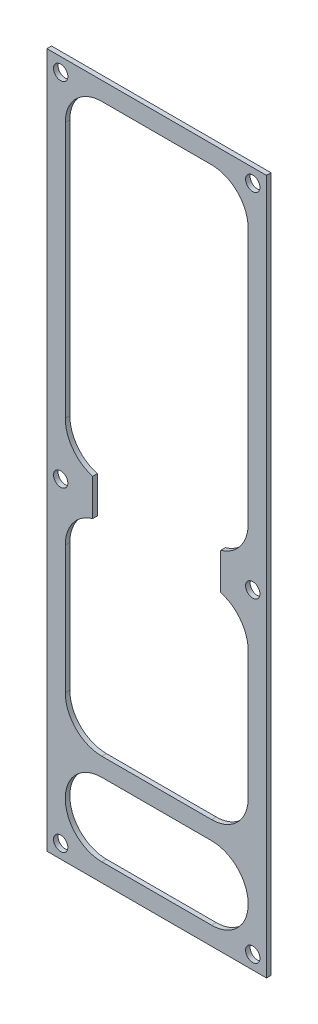
ISO-10303-21;
HEADER;
FILE_DESCRIPTION(('STEP AP214'),'2;1');
FILE_NAME('part.step','',(''),(''),'','','');
FILE_SCHEMA(('AUTOMOTIVE_DESIGN { 1 0 10303 214 1 1 1 1 }'));
ENDSEC;
DATA;
#1=APPLICATION_CONTEXT('core data for automotive mechanical design processes');
#2=APPLICATION_PROTOCOL_DEFINITION('international standard','automotive_design',2000,#1);
#3=PRODUCT_CONTEXT('',#1,'mechanical');
#4=PRODUCT('Part','Part','',(#3));
#5=PRODUCT_RELATED_PRODUCT_CATEGORY('part','',(#4));
#6=PRODUCT_DEFINITION_FORMATION('','',#4);
#7=PRODUCT_DEFINITION_CONTEXT('part definition',#1,'design');
#8=PRODUCT_DEFINITION('design','',#6,#7);
#9=PRODUCT_DEFINITION_SHAPE('','',#8);
#10=(LENGTH_UNIT() NAMED_UNIT(*) SI_UNIT(.MILLI.,.METRE.));
#11=(NAMED_UNIT(*) PLANE_ANGLE_UNIT() SI_UNIT($,.RADIAN.));
#12=(NAMED_UNIT(*) SI_UNIT($,.STERADIAN.) SOLID_ANGLE_UNIT());
#13=UNCERTAINTY_MEASURE_WITH_UNIT(LENGTH_MEASURE(1.E-05),#10,'distance_accuracy_value','');
#14=(GEOMETRIC_REPRESENTATION_CONTEXT(3) GLOBAL_UNCERTAINTY_ASSIGNED_CONTEXT((#13)) GLOBAL_UNIT_ASSIGNED_CONTEXT((#10,
#11,#12)) REPRESENTATION_CONTEXT('',''));
#15=CARTESIAN_POINT('',(0.,0.,0.));
#16=DIRECTION('',(0.,0.,1.));
#17=DIRECTION('',(1.,0.,0.));
#18=AXIS2_PLACEMENT_3D('',#15,#16,#17);
#19=CARTESIAN_POINT('',(0.,0.,1.5875));
#20=DIRECTION('',(1.,0.,0.));
#21=DIRECTION('',(0.,1.,0.));
#22=AXIS2_PLACEMENT_3D('',#19,#20,#21);
#23=PLANE('',#22);
#24=DIRECTION('',(0.,-1.,0.));
#25=VECTOR('',#24,1.);
#26=CARTESIAN_POINT('',(0.,0.,0.));
#27=LINE('',#26,#25);
#28=CARTESIAN_POINT('',(0.,0.,0.));
#29=VERTEX_POINT('',#28);
#30=CARTESIAN_POINT('',(0.,-241.3,0.));
#31=VERTEX_POINT('',#30);
#32=EDGE_CURVE('E308',#29,#31,#27,.T.);
#33=ORIENTED_EDGE('',*,*,#32,.T.);
#34=DIRECTION('',(0.,0.,-1.));
#35=VECTOR('',#34,1.);
#36=CARTESIAN_POINT('',(0.,-241.3,1.5875));
#37=LINE('',#36,#35);
#38=CARTESIAN_POINT('',(0.,-241.3,1.5875));
#39=VERTEX_POINT('',#38);
#40=EDGE_CURVE('E11',#39,#31,#37,.T.);
#41=ORIENTED_EDGE('',*,*,#40,.F.);
#42=DIRECTION('',(0.,-1.,0.));
#43=VECTOR('',#42,1.);
#44=CARTESIAN_POINT('',(0.,0.,1.5875));
#45=LINE('',#44,#43);
#46=CARTESIAN_POINT('',(0.,0.,1.5875));
#47=VERTEX_POINT('',#46);
#48=EDGE_CURVE('E366',#47,#39,#45,.T.);
#49=ORIENTED_EDGE('',*,*,#48,.F.);
#50=DIRECTION('',(0.,0.,-1.));
#51=VECTOR('',#50,1.);
#52=CARTESIAN_POINT('',(0.,0.,1.5875));
#53=LINE('',#52,#51);
#54=EDGE_CURVE('E376',#47,#29,#53,.T.);
#55=ORIENTED_EDGE('',*,*,#54,.T.);
#56=EDGE_LOOP('',(#33,#41,#49,#55));
#57=FACE_BOUND('',#56,.T.);
#58=ADVANCED_FACE('F36',(#57),#23,.F.);
#59=CARTESIAN_POINT('',(0.,-241.3,1.5875));
#60=DIRECTION('',(0.,1.,0.));
#61=DIRECTION('',(0.,0.,1.));
#62=AXIS2_PLACEMENT_3D('',#59,#60,#61);
#63=PLANE('',#62);
#64=DIRECTION('',(1.,0.,0.));
#65=VECTOR('',#64,1.);
#66=CARTESIAN_POINT('',(0.,-241.3,0.));
#67=LINE('',#66,#65);
#68=CARTESIAN_POINT('',(76.2,-241.3,0.));
#69=VERTEX_POINT('',#68);
#70=EDGE_CURVE('E379',#31,#69,#67,.T.);
#71=ORIENTED_EDGE('',*,*,#70,.T.);
#72=DIRECTION('',(0.,0.,-1.));
#73=VECTOR('',#72,1.);
#74=CARTESIAN_POINT('',(76.2,-241.3,1.5875));
#75=LINE('',#74,#73);
#76=CARTESIAN_POINT('',(76.2,-241.3,1.5875));
#77=VERTEX_POINT('',#76);
#78=EDGE_CURVE('E43',#77,#69,#75,.T.);
#79=ORIENTED_EDGE('',*,*,#78,.F.);
#80=DIRECTION('',(1.,0.,0.));
#81=VECTOR('',#80,1.);
#82=CARTESIAN_POINT('',(0.,-241.3,1.5875));
#83=LINE('',#82,#81);
#84=EDGE_CURVE('E369',#39,#77,#83,.T.);
#85=ORIENTED_EDGE('',*,*,#84,.F.);
#86=ORIENTED_EDGE('',*,*,#40,.T.);
#87=EDGE_LOOP('',(#71,#79,#85,#86));
#88=FACE_BOUND('',#87,.T.);
#89=ADVANCED_FACE('F408',(#88),#63,.F.);
#90=CARTESIAN_POINT('',(76.2,0.,1.5875));
#91=DIRECTION('',(-1.,0.,0.));
#92=DIRECTION('',(0.,-1.,0.));
#93=AXIS2_PLACEMENT_3D('',#90,#91,#92);
#94=PLANE('',#93);
#95=DIRECTION('',(0.,1.,0.));
#96=VECTOR('',#95,1.);
#97=CARTESIAN_POINT('',(76.2,0.,0.));
#98=LINE('',#97,#96);
#99=CARTESIAN_POINT('',(76.2,0.,0.));
#100=VERTEX_POINT('',#99);
#101=EDGE_CURVE('E381',#69,#100,#98,.T.);
#102=ORIENTED_EDGE('',*,*,#101,.T.);
#103=DIRECTION('',(0.,0.,-1.));
#104=VECTOR('',#103,1.);
#105=CARTESIAN_POINT('',(76.2,0.,1.5875));
#106=LINE('',#105,#104);
#107=CARTESIAN_POINT('',(76.2,0.,1.5875));
#108=VERTEX_POINT('',#107);
#109=EDGE_CURVE('E386',#108,#100,#106,.T.);
#110=ORIENTED_EDGE('',*,*,#109,.F.);
#111=DIRECTION('',(0.,1.,0.));
#112=VECTOR('',#111,1.);
#113=CARTESIAN_POINT('',(76.2,0.,1.5875));
#114=LINE('',#113,#112);
#115=EDGE_CURVE('E372',#77,#108,#114,.T.);
#116=ORIENTED_EDGE('',*,*,#115,.F.);
#117=ORIENTED_EDGE('',*,*,#78,.T.);
#118=EDGE_LOOP('',(#102,#110,#116,#117));
#119=FACE_BOUND('',#118,.T.);
#120=ADVANCED_FACE('F393',(#119),#94,.F.);
#121=CARTESIAN_POINT('',(0.,0.,1.5875));
#122=DIRECTION('',(0.,-1.,0.));
#123=DIRECTION('',(0.,0.,-1.));
#124=AXIS2_PLACEMENT_3D('',#121,#122,#123);
#125=PLANE('',#124);
#126=DIRECTION('',(-1.,0.,0.));
#127=VECTOR('',#126,1.);
#128=CARTESIAN_POINT('',(0.,0.,0.));
#129=LINE('',#128,#127);
#130=EDGE_CURVE('E370',#100,#29,#129,.T.);
#131=ORIENTED_EDGE('',*,*,#130,.T.);
#132=ORIENTED_EDGE('',*,*,#54,.F.);
#133=DIRECTION('',(-1.,0.,0.));
#134=VECTOR('',#133,1.);
#135=CARTESIAN_POINT('',(0.,0.,1.5875));
#136=LINE('',#135,#134);
#137=EDGE_CURVE('E374',#108,#47,#136,.T.);
#138=ORIENTED_EDGE('',*,*,#137,.F.);
#139=ORIENTED_EDGE('',*,*,#109,.T.);
#140=EDGE_LOOP('',(#131,#132,#138,#139));
#141=FACE_BOUND('',#140,.T.);
#142=ADVANCED_FACE('F401',(#141),#125,.F.);
#143=CARTESIAN_POINT('',(0.,0.,1.5875));
#144=DIRECTION('',(0.,0.,1.));
#145=DIRECTION('',(1.,0.,0.));
#146=AXIS2_PLACEMENT_3D('',#143,#144,#145);
#147=PLANE('',#146);
#148=CARTESIAN_POINT('',(71.4375,-4.7625,1.5875));
#149=DIRECTION('',(0.,0.,1.));
#150=DIRECTION('',(1.,0.,0.));
#151=AXIS2_PLACEMENT_3D('',#148,#149,#150);
#152=CIRCLE('',#151,2.4892);
#153=CARTESIAN_POINT('',(73.9267,-4.7625,1.5875));
#154=VERTEX_POINT('',#153);
#155=EDGE_CURVE('E539',#154,#154,#152,.T.);
#156=ORIENTED_EDGE('',*,*,#155,.F.);
#157=EDGE_LOOP('',(#156));
#158=FACE_BOUND('',#157,.T.);
#159=CARTESIAN_POINT('',(71.4375,-127.,1.5875));
#160=DIRECTION('',(0.,0.,1.));
#161=DIRECTION('',(1.,0.,0.));
#162=AXIS2_PLACEMENT_3D('',#159,#160,#161);
#163=CIRCLE('',#162,2.48920000000001);
#164=CARTESIAN_POINT('',(73.9267,-127.,1.5875));
#165=VERTEX_POINT('',#164);
#166=EDGE_CURVE('E545',#165,#165,#163,.T.);
#167=ORIENTED_EDGE('',*,*,#166,.F.);
#168=EDGE_LOOP('',(#167));
#169=FACE_BOUND('',#168,.T.);
#170=CARTESIAN_POINT('',(4.76250000000002,-127.,1.5875));
#171=DIRECTION('',(0.,0.,1.));
#172=DIRECTION('',(1.,0.,0.));
#173=AXIS2_PLACEMENT_3D('',#170,#171,#172);
#174=CIRCLE('',#173,2.4892);
#175=CARTESIAN_POINT('',(7.25170000000002,-127.,1.5875));
#176=VERTEX_POINT('',#175);
#177=EDGE_CURVE('E551',#176,#176,#174,.T.);
#178=ORIENTED_EDGE('',*,*,#177,.F.);
#179=EDGE_LOOP('',(#178));
#180=FACE_BOUND('',#179,.T.);
#181=CARTESIAN_POINT('',(4.76250000000003,-236.5375,1.5875));
#182=DIRECTION('',(0.,0.,1.));
#183=DIRECTION('',(1.,0.,0.));
#184=AXIS2_PLACEMENT_3D('',#181,#182,#183);
#185=CIRCLE('',#184,2.4892);
#186=CARTESIAN_POINT('',(7.25170000000003,-236.5375,1.5875));
#187=VERTEX_POINT('',#186);
#188=EDGE_CURVE('E533',#187,#187,#185,.T.);
#189=ORIENTED_EDGE('',*,*,#188,.F.);
#190=EDGE_LOOP('',(#189));
#191=FACE_BOUND('',#190,.T.);
#192=CARTESIAN_POINT('',(71.4375,-236.5375,1.5875));
#193=DIRECTION('',(0.,0.,1.));
#194=DIRECTION('',(1.,0.,0.));
#195=AXIS2_PLACEMENT_3D('',#192,#193,#194);
#196=CIRCLE('',#195,2.48920000000001);
#197=CARTESIAN_POINT('',(73.9267,-236.5375,1.5875));
#198=VERTEX_POINT('',#197);
#199=EDGE_CURVE('E530',#198,#198,#196,.T.);
#200=ORIENTED_EDGE('',*,*,#199,.F.);
#201=EDGE_LOOP('',(#200));
#202=FACE_BOUND('',#201,.T.);
#203=CARTESIAN_POINT('',(4.7625,-4.76250000000001,1.5875));
#204=DIRECTION('',(0.,0.,1.));
#205=DIRECTION('',(1.,0.,0.));
#206=AXIS2_PLACEMENT_3D('',#203,#204,#205);
#207=CIRCLE('',#206,2.4892);
#208=CARTESIAN_POINT('',(7.2517,-4.76250000000001,1.5875));
#209=VERTEX_POINT('',#208);
#210=EDGE_CURVE('E224',#209,#209,#207,.T.);
#211=ORIENTED_EDGE('',*,*,#210,.F.);
#212=EDGE_LOOP('',(#211));
#213=FACE_BOUND('',#212,.T.);
#214=CARTESIAN_POINT('',(56.6208333333333,-107.95,1.5875));
#215=DIRECTION('',(0.,0.,1.));
#216=DIRECTION('',(-1.,0.,0.));
#217=AXIS2_PLACEMENT_3D('',#214,#215,#216);
#218=CIRCLE('',#217,13.2291666666667);
#219=CARTESIAN_POINT('',(60.325,-120.65,1.5875));
#220=VERTEX_POINT('',#219);
#221=CARTESIAN_POINT('',(69.85,-107.95,1.5875));
#222=VERTEX_POINT('',#221);
#223=EDGE_CURVE('E50',#220,#222,#218,.T.);
#224=ORIENTED_EDGE('',*,*,#223,.F.);
#225=DIRECTION('',(0.,1.,0.));
#226=VECTOR('',#225,1.);
#227=CARTESIAN_POINT('',(60.325,-120.65,1.5875));
#228=LINE('',#227,#226);
#229=CARTESIAN_POINT('',(60.325,-133.35,1.5875));
#230=VERTEX_POINT('',#229);
#231=EDGE_CURVE('E218',#230,#220,#228,.T.);
#232=ORIENTED_EDGE('',*,*,#231,.F.);
#233=CARTESIAN_POINT('',(56.6208333333333,-146.05,1.5875));
#234=DIRECTION('',(0.,0.,1.));
#235=DIRECTION('',(1.,0.,0.));
#236=AXIS2_PLACEMENT_3D('',#233,#234,#235);
#237=CIRCLE('',#236,13.2291666666667);
#238=CARTESIAN_POINT('',(69.85,-146.05,1.5875));
#239=VERTEX_POINT('',#238);
#240=EDGE_CURVE('E221',#239,#230,#237,.T.);
#241=ORIENTED_EDGE('',*,*,#240,.F.);
#242=DIRECTION('',(0.,1.,0.));
#243=VECTOR('',#242,1.);
#244=CARTESIAN_POINT('',(69.85,-190.5,1.5875));
#245=LINE('',#244,#243);
#246=CARTESIAN_POINT('',(69.85,-190.5,1.5875));
#247=VERTEX_POINT('',#246);
#248=EDGE_CURVE('E301',#247,#239,#245,.T.);
#249=ORIENTED_EDGE('',*,*,#248,.F.);
#250=CARTESIAN_POINT('',(57.15,-190.5,1.5875));
#251=DIRECTION('',(0.,0.,1.));
#252=DIRECTION('',(1.,0.,0.));
#253=AXIS2_PLACEMENT_3D('',#250,#251,#252);
#254=CIRCLE('',#253,12.7);
#255=CARTESIAN_POINT('',(57.1499999999999,-203.2,1.5875));
#256=VERTEX_POINT('',#255);
#257=EDGE_CURVE('E298',#256,#247,#254,.T.);
#258=ORIENTED_EDGE('',*,*,#257,.F.);
#259=DIRECTION('',(1.,0.,0.));
#260=VECTOR('',#259,1.);
#261=CARTESIAN_POINT('',(19.0500000000001,-203.2,1.5875));
#262=LINE('',#261,#260);
#263=CARTESIAN_POINT('',(19.0500000000001,-203.2,1.5875));
#264=VERTEX_POINT('',#263);
#265=EDGE_CURVE('E295',#264,#256,#262,.T.);
#266=ORIENTED_EDGE('',*,*,#265,.F.);
#267=CARTESIAN_POINT('',(19.05,-190.5,1.5875));
#268=DIRECTION('',(0.,0.,1.));
#269=DIRECTION('',(-1.,0.,0.));
#270=AXIS2_PLACEMENT_3D('',#267,#268,#269);
#271=CIRCLE('',#270,12.7);
#272=CARTESIAN_POINT('',(6.35000000000001,-190.5,1.5875));
#273=VERTEX_POINT('',#272);
#274=EDGE_CURVE('E292',#273,#264,#271,.T.);
#275=ORIENTED_EDGE('',*,*,#274,.F.);
#276=DIRECTION('',(0.,-1.,0.));
#277=VECTOR('',#276,1.);
#278=CARTESIAN_POINT('',(6.35000000000001,-190.5,1.5875));
#279=LINE('',#278,#277);
#280=CARTESIAN_POINT('',(6.35,-146.05,1.5875));
#281=VERTEX_POINT('',#280);
#282=EDGE_CURVE('E289',#281,#273,#279,.T.);
#283=ORIENTED_EDGE('',*,*,#282,.F.);
#284=CARTESIAN_POINT('',(19.5791666666667,-146.05,1.5875));
#285=DIRECTION('',(0.,0.,1.));
#286=DIRECTION('',(-1.,0.,0.));
#287=AXIS2_PLACEMENT_3D('',#284,#285,#286);
#288=CIRCLE('',#287,13.2291666666667);
#289=CARTESIAN_POINT('',(15.875,-133.35,1.5875));
#290=VERTEX_POINT('',#289);
#291=EDGE_CURVE('E286',#290,#281,#288,.T.);
#292=ORIENTED_EDGE('',*,*,#291,.F.);
#293=DIRECTION('',(0.,-1.,0.));
#294=VECTOR('',#293,1.);
#295=CARTESIAN_POINT('',(15.875,-120.65,1.5875));
#296=LINE('',#295,#294);
#297=CARTESIAN_POINT('',(15.875,-120.65,1.5875));
#298=VERTEX_POINT('',#297);
#299=EDGE_CURVE('E283',#298,#290,#296,.T.);
#300=ORIENTED_EDGE('',*,*,#299,.F.);
#301=CARTESIAN_POINT('',(19.5791666666667,-107.95,1.5875));
#302=DIRECTION('',(0.,0.,1.));
#303=DIRECTION('',(1.,0.,0.));
#304=AXIS2_PLACEMENT_3D('',#301,#302,#303);
#305=CIRCLE('',#304,13.2291666666667);
#306=CARTESIAN_POINT('',(6.35000000000001,-107.95,1.5875));
#307=VERTEX_POINT('',#306);
#308=EDGE_CURVE('E280',#307,#298,#305,.T.);
#309=ORIENTED_EDGE('',*,*,#308,.F.);
#310=DIRECTION('',(0.,-1.,0.));
#311=VECTOR('',#310,1.);
#312=CARTESIAN_POINT('',(6.35,-19.0500000000001,1.5875));
#313=LINE('',#312,#311);
#314=CARTESIAN_POINT('',(6.35,-19.0500000000001,1.5875));
#315=VERTEX_POINT('',#314);
#316=EDGE_CURVE('E277',#315,#307,#313,.T.);
#317=ORIENTED_EDGE('',*,*,#316,.F.);
#318=CARTESIAN_POINT('',(19.05,-19.05,1.5875));
#319=DIRECTION('',(0.,0.,1.));
#320=DIRECTION('',(1.,0.,0.));
#321=AXIS2_PLACEMENT_3D('',#318,#319,#320);
#322=CIRCLE('',#321,12.7);
#323=CARTESIAN_POINT('',(19.0500000000001,-6.35,1.5875));
#324=VERTEX_POINT('',#323);
#325=EDGE_CURVE('E274',#324,#315,#322,.T.);
#326=ORIENTED_EDGE('',*,*,#325,.F.);
#327=DIRECTION('',(-1.,0.,0.));
#328=VECTOR('',#327,1.);
#329=CARTESIAN_POINT('',(19.0500000000001,-6.35,1.5875));
#330=LINE('',#329,#328);
#331=CARTESIAN_POINT('',(57.1499999999999,-6.35,1.5875));
#332=VERTEX_POINT('',#331);
#333=EDGE_CURVE('E271',#332,#324,#330,.T.);
#334=ORIENTED_EDGE('',*,*,#333,.F.);
#335=CARTESIAN_POINT('',(57.15,-19.05,1.5875));
#336=DIRECTION('',(0.,0.,1.));
#337=DIRECTION('',(-1.,0.,0.));
#338=AXIS2_PLACEMENT_3D('',#335,#336,#337);
#339=CIRCLE('',#338,12.7);
#340=CARTESIAN_POINT('',(69.85,-19.0500000000001,1.5875));
#341=VERTEX_POINT('',#340);
#342=EDGE_CURVE('E268',#341,#332,#339,.T.);
#343=ORIENTED_EDGE('',*,*,#342,.F.);
#344=DIRECTION('',(0.,1.,0.));
#345=VECTOR('',#344,1.);
#346=CARTESIAN_POINT('',(69.85,-19.0500000000001,1.5875));
#347=LINE('',#346,#345);
#348=EDGE_CURVE('E265',#222,#341,#347,.T.);
#349=ORIENTED_EDGE('',*,*,#348,.F.);
#350=EDGE_LOOP('',(#224,#232,#241,#249,#258,#266,#275,#283,#292,#300,#309,#317,#326,#334,#343,#349));
#351=FACE_BOUND('',#350,.T.);
#352=CARTESIAN_POINT('',(19.05,-222.25,1.5875));
#353=DIRECTION('',(0.,0.,1.));
#354=DIRECTION('',(-1.,0.,0.));
#355=AXIS2_PLACEMENT_3D('',#352,#353,#354);
#356=CIRCLE('',#355,12.7);
#357=CARTESIAN_POINT('',(19.05,-209.55,1.5875));
#358=VERTEX_POINT('',#357);
#359=CARTESIAN_POINT('',(19.05,-234.95,1.5875));
#360=VERTEX_POINT('',#359);
#361=EDGE_CURVE('E58',#358,#360,#356,.T.);
#362=ORIENTED_EDGE('',*,*,#361,.F.);
#363=DIRECTION('',(-1.,0.,0.));
#364=VECTOR('',#363,1.);
#365=CARTESIAN_POINT('',(19.05,-209.55,1.5875));
#366=LINE('',#365,#364);
#367=CARTESIAN_POINT('',(57.15,-209.55,1.5875));
#368=VERTEX_POINT('',#367);
#369=EDGE_CURVE('E340',#368,#358,#366,.T.);
#370=ORIENTED_EDGE('',*,*,#369,.F.);
#371=CARTESIAN_POINT('',(57.15,-222.25,1.5875));
#372=DIRECTION('',(0.,0.,1.));
#373=DIRECTION('',(1.,0.,0.));
#374=AXIS2_PLACEMENT_3D('',#371,#372,#373);
#375=CIRCLE('',#374,12.7);
#376=CARTESIAN_POINT('',(57.15,-234.95,1.5875));
#377=VERTEX_POINT('',#376);
#378=EDGE_CURVE('E355',#377,#368,#375,.T.);
#379=ORIENTED_EDGE('',*,*,#378,.F.);
#380=DIRECTION('',(1.,0.,0.));
#381=VECTOR('',#380,1.);
#382=CARTESIAN_POINT('',(19.05,-234.95,1.5875));
#383=LINE('',#382,#381);
#384=EDGE_CURVE('E351',#360,#377,#383,.T.);
#385=ORIENTED_EDGE('',*,*,#384,.F.);
#386=EDGE_LOOP('',(#362,#370,#379,#385));
#387=FACE_BOUND('',#386,.T.);
#388=ORIENTED_EDGE('',*,*,#48,.T.);
#389=ORIENTED_EDGE('',*,*,#84,.T.);
#390=ORIENTED_EDGE('',*,*,#115,.T.);
#391=ORIENTED_EDGE('',*,*,#137,.T.);
#392=EDGE_LOOP('',(#388,#389,#390,#391));
#393=FACE_BOUND('',#392,.T.);
#394=ADVANCED_FACE('F407',(#158,#169,#180,#191,#202,#213,#351,#387,#393),#147,.T.);
#395=CARTESIAN_POINT('',(0.,0.,0.));
#396=DIRECTION('',(0.,0.,1.));
#397=DIRECTION('',(1.,0.,0.));
#398=AXIS2_PLACEMENT_3D('',#395,#396,#397);
#399=PLANE('',#398);
#400=CARTESIAN_POINT('',(71.4375,-4.7625,0.));
#401=DIRECTION('',(0.,0.,1.));
#402=DIRECTION('',(1.,0.,0.));
#403=AXIS2_PLACEMENT_3D('',#400,#401,#402);
#404=CIRCLE('',#403,2.4892);
#405=CARTESIAN_POINT('',(73.9267,-4.7625,0.));
#406=VERTEX_POINT('',#405);
#407=EDGE_CURVE('E536',#406,#406,#404,.T.);
#408=ORIENTED_EDGE('',*,*,#407,.T.);
#409=EDGE_LOOP('',(#408));
#410=FACE_BOUND('',#409,.T.);
#411=CARTESIAN_POINT('',(71.4375,-127.,0.));
#412=DIRECTION('',(0.,0.,1.));
#413=DIRECTION('',(1.,0.,0.));
#414=AXIS2_PLACEMENT_3D('',#411,#412,#413);
#415=CIRCLE('',#414,2.48920000000001);
#416=CARTESIAN_POINT('',(73.9267,-127.,0.));
#417=VERTEX_POINT('',#416);
#418=EDGE_CURVE('E542',#417,#417,#415,.T.);
#419=ORIENTED_EDGE('',*,*,#418,.T.);
#420=EDGE_LOOP('',(#419));
#421=FACE_BOUND('',#420,.T.);
#422=CARTESIAN_POINT('',(4.76250000000002,-127.,0.));
#423=DIRECTION('',(0.,0.,1.));
#424=DIRECTION('',(1.,0.,0.));
#425=AXIS2_PLACEMENT_3D('',#422,#423,#424);
#426=CIRCLE('',#425,2.4892);
#427=CARTESIAN_POINT('',(7.25170000000002,-127.,0.));
#428=VERTEX_POINT('',#427);
#429=EDGE_CURVE('E548',#428,#428,#426,.T.);
#430=ORIENTED_EDGE('',*,*,#429,.T.);
#431=EDGE_LOOP('',(#430));
#432=FACE_BOUND('',#431,.T.);
#433=CARTESIAN_POINT('',(4.76250000000003,-236.5375,0.));
#434=DIRECTION('',(0.,0.,1.));
#435=DIRECTION('',(1.,0.,0.));
#436=AXIS2_PLACEMENT_3D('',#433,#434,#435);
#437=CIRCLE('',#436,2.4892);
#438=CARTESIAN_POINT('',(7.25170000000003,-236.5375,0.));
#439=VERTEX_POINT('',#438);
#440=EDGE_CURVE('E554',#439,#439,#437,.T.);
#441=ORIENTED_EDGE('',*,*,#440,.T.);
#442=EDGE_LOOP('',(#441));
#443=FACE_BOUND('',#442,.T.);
#444=CARTESIAN_POINT('',(71.4375,-236.5375,0.));
#445=DIRECTION('',(0.,0.,1.));
#446=DIRECTION('',(1.,0.,0.));
#447=AXIS2_PLACEMENT_3D('',#444,#445,#446);
#448=CIRCLE('',#447,2.48920000000001);
#449=CARTESIAN_POINT('',(73.9267,-236.5375,0.));
#450=VERTEX_POINT('',#449);
#451=EDGE_CURVE('E527',#450,#450,#448,.T.);
#452=ORIENTED_EDGE('',*,*,#451,.T.);
#453=EDGE_LOOP('',(#452));
#454=FACE_BOUND('',#453,.T.);
#455=CARTESIAN_POINT('',(4.7625,-4.76250000000001,0.));
#456=DIRECTION('',(0.,0.,1.));
#457=DIRECTION('',(1.,0.,0.));
#458=AXIS2_PLACEMENT_3D('',#455,#456,#457);
#459=CIRCLE('',#458,2.4892);
#460=CARTESIAN_POINT('',(7.2517,-4.76250000000001,0.));
#461=VERTEX_POINT('',#460);
#462=EDGE_CURVE('E352',#461,#461,#459,.T.);
#463=ORIENTED_EDGE('',*,*,#462,.T.);
#464=EDGE_LOOP('',(#463));
#465=FACE_BOUND('',#464,.T.);
#466=DIRECTION('',(0.,1.,0.));
#467=VECTOR('',#466,1.);
#468=CARTESIAN_POINT('',(60.325,-120.65,0.));
#469=LINE('',#468,#467);
#470=CARTESIAN_POINT('',(60.325,-133.35,0.));
#471=VERTEX_POINT('',#470);
#472=CARTESIAN_POINT('',(60.325,-120.65,0.));
#473=VERTEX_POINT('',#472);
#474=EDGE_CURVE('E204',#471,#473,#469,.T.);
#475=ORIENTED_EDGE('',*,*,#474,.T.);
#476=CARTESIAN_POINT('',(56.6208333333333,-107.95,0.));
#477=DIRECTION('',(0.,0.,1.));
#478=DIRECTION('',(-1.,0.,0.));
#479=AXIS2_PLACEMENT_3D('',#476,#477,#478);
#480=CIRCLE('',#479,13.2291666666667);
#481=CARTESIAN_POINT('',(69.85,-107.95,0.));
#482=VERTEX_POINT('',#481);
#483=EDGE_CURVE('E198',#473,#482,#480,.T.);
#484=ORIENTED_EDGE('',*,*,#483,.T.);
#485=DIRECTION('',(0.,1.,0.));
#486=VECTOR('',#485,1.);
#487=CARTESIAN_POINT('',(69.85,-19.0500000000001,0.));
#488=LINE('',#487,#486);
#489=CARTESIAN_POINT('',(69.85,-19.0500000000001,0.));
#490=VERTEX_POINT('',#489);
#491=EDGE_CURVE('E208',#482,#490,#488,.T.);
#492=ORIENTED_EDGE('',*,*,#491,.T.);
#493=CARTESIAN_POINT('',(57.15,-19.05,0.));
#494=DIRECTION('',(0.,0.,1.));
#495=DIRECTION('',(-1.,0.,0.));
#496=AXIS2_PLACEMENT_3D('',#493,#494,#495);
#497=CIRCLE('',#496,12.7);
#498=CARTESIAN_POINT('',(57.1499999999999,-6.35,0.));
#499=VERTEX_POINT('',#498);
#500=EDGE_CURVE('E212',#490,#499,#497,.T.);
#501=ORIENTED_EDGE('',*,*,#500,.T.);
#502=DIRECTION('',(-1.,0.,0.));
#503=VECTOR('',#502,1.);
#504=CARTESIAN_POINT('',(19.0500000000001,-6.35,0.));
#505=LINE('',#504,#503);
#506=CARTESIAN_POINT('',(19.0500000000001,-6.35,0.));
#507=VERTEX_POINT('',#506);
#508=EDGE_CURVE('E228',#499,#507,#505,.T.);
#509=ORIENTED_EDGE('',*,*,#508,.T.);
#510=CARTESIAN_POINT('',(19.05,-19.05,0.));
#511=DIRECTION('',(0.,0.,1.));
#512=DIRECTION('',(1.,0.,0.));
#513=AXIS2_PLACEMENT_3D('',#510,#511,#512);
#514=CIRCLE('',#513,12.7);
#515=CARTESIAN_POINT('',(6.35,-19.0500000000001,0.));
#516=VERTEX_POINT('',#515);
#517=EDGE_CURVE('E231',#507,#516,#514,.T.);
#518=ORIENTED_EDGE('',*,*,#517,.T.);
#519=DIRECTION('',(0.,-1.,0.));
#520=VECTOR('',#519,1.);
#521=CARTESIAN_POINT('',(6.35,-19.0500000000001,0.));
#522=LINE('',#521,#520);
#523=CARTESIAN_POINT('',(6.35000000000001,-107.95,0.));
#524=VERTEX_POINT('',#523);
#525=EDGE_CURVE('E234',#516,#524,#522,.T.);
#526=ORIENTED_EDGE('',*,*,#525,.T.);
#527=CARTESIAN_POINT('',(19.5791666666667,-107.95,0.));
#528=DIRECTION('',(0.,0.,1.));
#529=DIRECTION('',(1.,0.,0.));
#530=AXIS2_PLACEMENT_3D('',#527,#528,#529);
#531=CIRCLE('',#530,13.2291666666667);
#532=CARTESIAN_POINT('',(15.875,-120.65,0.));
#533=VERTEX_POINT('',#532);
#534=EDGE_CURVE('E237',#524,#533,#531,.T.);
#535=ORIENTED_EDGE('',*,*,#534,.T.);
#536=DIRECTION('',(0.,-1.,0.));
#537=VECTOR('',#536,1.);
#538=CARTESIAN_POINT('',(15.875,-120.65,0.));
#539=LINE('',#538,#537);
#540=CARTESIAN_POINT('',(15.875,-133.35,0.));
#541=VERTEX_POINT('',#540);
#542=EDGE_CURVE('E240',#533,#541,#539,.T.);
#543=ORIENTED_EDGE('',*,*,#542,.T.);
#544=CARTESIAN_POINT('',(19.5791666666667,-146.05,0.));
#545=DIRECTION('',(0.,0.,1.));
#546=DIRECTION('',(-1.,0.,0.));
#547=AXIS2_PLACEMENT_3D('',#544,#545,#546);
#548=CIRCLE('',#547,13.2291666666667);
#549=CARTESIAN_POINT('',(6.35,-146.05,0.));
#550=VERTEX_POINT('',#549);
#551=EDGE_CURVE('E243',#541,#550,#548,.T.);
#552=ORIENTED_EDGE('',*,*,#551,.T.);
#553=DIRECTION('',(0.,-1.,0.));
#554=VECTOR('',#553,1.);
#555=CARTESIAN_POINT('',(6.35000000000001,-190.5,0.));
#556=LINE('',#555,#554);
#557=CARTESIAN_POINT('',(6.35000000000001,-190.5,0.));
#558=VERTEX_POINT('',#557);
#559=EDGE_CURVE('E246',#550,#558,#556,.T.);
#560=ORIENTED_EDGE('',*,*,#559,.T.);
#561=CARTESIAN_POINT('',(19.05,-190.5,0.));
#562=DIRECTION('',(0.,0.,1.));
#563=DIRECTION('',(-1.,0.,0.));
#564=AXIS2_PLACEMENT_3D('',#561,#562,#563);
#565=CIRCLE('',#564,12.7);
#566=CARTESIAN_POINT('',(19.0500000000001,-203.2,0.));
#567=VERTEX_POINT('',#566);
#568=EDGE_CURVE('E249',#558,#567,#565,.T.);
#569=ORIENTED_EDGE('',*,*,#568,.T.);
#570=DIRECTION('',(1.,0.,0.));
#571=VECTOR('',#570,1.);
#572=CARTESIAN_POINT('',(19.0500000000001,-203.2,0.));
#573=LINE('',#572,#571);
#574=CARTESIAN_POINT('',(57.1499999999999,-203.2,0.));
#575=VERTEX_POINT('',#574);
#576=EDGE_CURVE('E252',#567,#575,#573,.T.);
#577=ORIENTED_EDGE('',*,*,#576,.T.);
#578=CARTESIAN_POINT('',(57.15,-190.5,0.));
#579=DIRECTION('',(0.,0.,1.));
#580=DIRECTION('',(1.,0.,0.));
#581=AXIS2_PLACEMENT_3D('',#578,#579,#580);
#582=CIRCLE('',#581,12.7);
#583=CARTESIAN_POINT('',(69.85,-190.5,0.));
#584=VERTEX_POINT('',#583);
#585=EDGE_CURVE('E255',#575,#584,#582,.T.);
#586=ORIENTED_EDGE('',*,*,#585,.T.);
#587=DIRECTION('',(0.,1.,0.));
#588=VECTOR('',#587,1.);
#589=CARTESIAN_POINT('',(69.85,-190.5,0.));
#590=LINE('',#589,#588);
#591=CARTESIAN_POINT('',(69.85,-146.05,0.));
#592=VERTEX_POINT('',#591);
#593=EDGE_CURVE('E258',#584,#592,#590,.T.);
#594=ORIENTED_EDGE('',*,*,#593,.T.);
#595=CARTESIAN_POINT('',(56.6208333333333,-146.05,0.));
#596=DIRECTION('',(0.,0.,1.));
#597=DIRECTION('',(1.,0.,0.));
#598=AXIS2_PLACEMENT_3D('',#595,#596,#597);
#599=CIRCLE('',#598,13.2291666666667);
#600=EDGE_CURVE('E261',#592,#471,#599,.T.);
#601=ORIENTED_EDGE('',*,*,#600,.T.);
#602=EDGE_LOOP('',(#475,#484,#492,#501,#509,#518,#526,#535,#543,#552,#560,#569,#577,#586,#594,#601));
#603=FACE_BOUND('',#602,.T.);
#604=DIRECTION('',(-1.,0.,0.));
#605=VECTOR('',#604,1.);
#606=CARTESIAN_POINT('',(19.05,-209.55,0.));
#607=LINE('',#606,#605);
#608=CARTESIAN_POINT('',(57.15,-209.55,0.));
#609=VERTEX_POINT('',#608);
#610=CARTESIAN_POINT('',(19.05,-209.55,0.));
#611=VERTEX_POINT('',#610);
#612=EDGE_CURVE('E346',#609,#611,#607,.T.);
#613=ORIENTED_EDGE('',*,*,#612,.T.);
#614=CARTESIAN_POINT('',(19.05,-222.25,0.));
#615=DIRECTION('',(0.,0.,1.));
#616=DIRECTION('',(-1.,0.,0.));
#617=AXIS2_PLACEMENT_3D('',#614,#615,#616);
#618=CIRCLE('',#617,12.7);
#619=CARTESIAN_POINT('',(19.05,-234.95,0.));
#620=VERTEX_POINT('',#619);
#621=EDGE_CURVE('E336',#611,#620,#618,.T.);
#622=ORIENTED_EDGE('',*,*,#621,.T.);
#623=DIRECTION('',(1.,0.,0.));
#624=VECTOR('',#623,1.);
#625=CARTESIAN_POINT('',(19.05,-234.95,0.));
#626=LINE('',#625,#624);
#627=CARTESIAN_POINT('',(57.15,-234.95,0.));
#628=VERTEX_POINT('',#627);
#629=EDGE_CURVE('E339',#620,#628,#626,.T.);
#630=ORIENTED_EDGE('',*,*,#629,.T.);
#631=CARTESIAN_POINT('',(57.15,-222.25,0.));
#632=DIRECTION('',(0.,0.,1.));
#633=DIRECTION('',(1.,0.,0.));
#634=AXIS2_PLACEMENT_3D('',#631,#632,#633);
#635=CIRCLE('',#634,12.7);
#636=EDGE_CURVE('E343',#628,#609,#635,.T.);
#637=ORIENTED_EDGE('',*,*,#636,.T.);
#638=EDGE_LOOP('',(#613,#622,#630,#637));
#639=FACE_BOUND('',#638,.T.);
#640=ORIENTED_EDGE('',*,*,#32,.F.);
#641=ORIENTED_EDGE('',*,*,#130,.F.);
#642=ORIENTED_EDGE('',*,*,#101,.F.);
#643=ORIENTED_EDGE('',*,*,#70,.F.);
#644=EDGE_LOOP('',(#640,#641,#642,#643));
#645=FACE_BOUND('',#644,.T.);
#646=ADVANCED_FACE('F214',(#410,#421,#432,#443,#454,#465,#603,#639,#645),#399,.F.);
#647=CARTESIAN_POINT('',(19.05,-222.25,0.));
#648=DIRECTION('',(0.,0.,1.));
#649=DIRECTION('',(1.,0.,0.));
#650=AXIS2_PLACEMENT_3D('',#647,#648,#649);
#651=CYLINDRICAL_SURFACE('',#650,12.7);
#652=ORIENTED_EDGE('',*,*,#361,.T.);
#653=DIRECTION('',(0.,0.,1.));
#654=VECTOR('',#653,1.);
#655=CARTESIAN_POINT('',(19.05,-234.95,0.));
#656=LINE('',#655,#654);
#657=EDGE_CURVE('E349',#620,#360,#656,.T.);
#658=ORIENTED_EDGE('',*,*,#657,.F.);
#659=ORIENTED_EDGE('',*,*,#621,.F.);
#660=DIRECTION('',(0.,0.,1.));
#661=VECTOR('',#660,1.);
#662=CARTESIAN_POINT('',(19.05,-209.55,0.));
#663=LINE('',#662,#661);
#664=EDGE_CURVE('E266',#611,#358,#663,.T.);
#665=ORIENTED_EDGE('',*,*,#664,.T.);
#666=EDGE_LOOP('',(#652,#658,#659,#665));
#667=FACE_BOUND('',#666,.T.);
#668=ADVANCED_FACE('F420',(#667),#651,.F.);
#669=CARTESIAN_POINT('',(19.05,-209.55,0.));
#670=DIRECTION('',(0.,1.,0.));
#671=DIRECTION('',(0.,0.,1.));
#672=AXIS2_PLACEMENT_3D('',#669,#670,#671);
#673=PLANE('',#672);
#674=ORIENTED_EDGE('',*,*,#369,.T.);
#675=ORIENTED_EDGE('',*,*,#664,.F.);
#676=ORIENTED_EDGE('',*,*,#612,.F.);
#677=DIRECTION('',(0.,0.,1.));
#678=VECTOR('',#677,1.);
#679=CARTESIAN_POINT('',(57.15,-209.55,0.));
#680=LINE('',#679,#678);
#681=EDGE_CURVE('E361',#609,#368,#680,.T.);
#682=ORIENTED_EDGE('',*,*,#681,.T.);
#683=EDGE_LOOP('',(#674,#675,#676,#682));
#684=FACE_BOUND('',#683,.T.);
#685=ADVANCED_FACE('F427',(#684),#673,.F.);
#686=CARTESIAN_POINT('',(57.15,-222.25,0.));
#687=DIRECTION('',(0.,0.,1.));
#688=DIRECTION('',(1.,0.,0.));
#689=AXIS2_PLACEMENT_3D('',#686,#687,#688);
#690=CYLINDRICAL_SURFACE('',#689,12.7);
#691=ORIENTED_EDGE('',*,*,#378,.T.);
#692=ORIENTED_EDGE('',*,*,#681,.F.);
#693=ORIENTED_EDGE('',*,*,#636,.F.);
#694=DIRECTION('',(0.,0.,1.));
#695=VECTOR('',#694,1.);
#696=CARTESIAN_POINT('',(57.15,-234.95,0.));
#697=LINE('',#696,#695);
#698=EDGE_CURVE('E363',#628,#377,#697,.T.);
#699=ORIENTED_EDGE('',*,*,#698,.T.);
#700=EDGE_LOOP('',(#691,#692,#693,#699));
#701=FACE_BOUND('',#700,.T.);
#702=ADVANCED_FACE('F431',(#701),#690,.F.);
#703=CARTESIAN_POINT('',(19.05,-234.95,0.));
#704=DIRECTION('',(0.,-1.,0.));
#705=DIRECTION('',(0.,0.,-1.));
#706=AXIS2_PLACEMENT_3D('',#703,#704,#705);
#707=PLANE('',#706);
#708=ORIENTED_EDGE('',*,*,#384,.T.);
#709=ORIENTED_EDGE('',*,*,#698,.F.);
#710=ORIENTED_EDGE('',*,*,#629,.F.);
#711=ORIENTED_EDGE('',*,*,#657,.T.);
#712=EDGE_LOOP('',(#708,#709,#710,#711));
#713=FACE_BOUND('',#712,.T.);
#714=ADVANCED_FACE('F428',(#713),#707,.F.);
#715=CARTESIAN_POINT('',(56.6208333333333,-107.95,0.));
#716=DIRECTION('',(0.,0.,1.));
#717=DIRECTION('',(1.,0.,0.));
#718=AXIS2_PLACEMENT_3D('',#715,#716,#717);
#719=CYLINDRICAL_SURFACE('',#718,13.2291666666667);
#720=ORIENTED_EDGE('',*,*,#223,.T.);
#721=DIRECTION('',(0.,0.,1.));
#722=VECTOR('',#721,1.);
#723=CARTESIAN_POINT('',(69.85,-107.95,0.));
#724=LINE('',#723,#722);
#725=EDGE_CURVE('E194',#482,#222,#724,.T.);
#726=ORIENTED_EDGE('',*,*,#725,.F.);
#727=ORIENTED_EDGE('',*,*,#483,.F.);
#728=DIRECTION('',(0.,0.,1.));
#729=VECTOR('',#728,1.);
#730=CARTESIAN_POINT('',(60.325,-120.65,0.));
#731=LINE('',#730,#729);
#732=EDGE_CURVE('E306',#473,#220,#731,.T.);
#733=ORIENTED_EDGE('',*,*,#732,.T.);
#734=EDGE_LOOP('',(#720,#726,#727,#733));
#735=FACE_BOUND('',#734,.T.);
#736=ADVANCED_FACE('F196',(#735),#719,.F.);
#737=CARTESIAN_POINT('',(60.325,-120.65,0.));
#738=DIRECTION('',(1.,0.,0.));
#739=DIRECTION('',(0.,1.,0.));
#740=AXIS2_PLACEMENT_3D('',#737,#738,#739);
#741=PLANE('',#740);
#742=ORIENTED_EDGE('',*,*,#231,.T.);
#743=ORIENTED_EDGE('',*,*,#732,.F.);
#744=ORIENTED_EDGE('',*,*,#474,.F.);
#745=DIRECTION('',(0.,0.,1.));
#746=VECTOR('',#745,1.);
#747=CARTESIAN_POINT('',(60.325,-133.35,0.));
#748=LINE('',#747,#746);
#749=EDGE_CURVE('E309',#471,#230,#748,.T.);
#750=ORIENTED_EDGE('',*,*,#749,.T.);
#751=EDGE_LOOP('',(#742,#743,#744,#750));
#752=FACE_BOUND('',#751,.T.);
#753=ADVANCED_FACE('F441',(#752),#741,.F.);
#754=CARTESIAN_POINT('',(56.6208333333333,-146.05,0.));
#755=DIRECTION('',(0.,0.,1.));
#756=DIRECTION('',(1.,0.,0.));
#757=AXIS2_PLACEMENT_3D('',#754,#755,#756);
#758=CYLINDRICAL_SURFACE('',#757,13.2291666666667);
#759=ORIENTED_EDGE('',*,*,#240,.T.);
#760=ORIENTED_EDGE('',*,*,#749,.F.);
#761=ORIENTED_EDGE('',*,*,#600,.F.);
#762=DIRECTION('',(0.,0.,1.));
#763=VECTOR('',#762,1.);
#764=CARTESIAN_POINT('',(69.85,-146.05,0.));
#765=LINE('',#764,#763);
#766=EDGE_CURVE('E311',#592,#239,#765,.T.);
#767=ORIENTED_EDGE('',*,*,#766,.T.);
#768=EDGE_LOOP('',(#759,#760,#761,#767));
#769=FACE_BOUND('',#768,.T.);
#770=ADVANCED_FACE('F492',(#769),#758,.F.);
#771=CARTESIAN_POINT('',(69.85,-190.5,0.));
#772=DIRECTION('',(1.,0.,0.));
#773=DIRECTION('',(0.,0.,-1.));
#774=AXIS2_PLACEMENT_3D('',#771,#772,#773);
#775=PLANE('',#774);
#776=ORIENTED_EDGE('',*,*,#248,.T.);
#777=ORIENTED_EDGE('',*,*,#766,.F.);
#778=ORIENTED_EDGE('',*,*,#593,.F.);
#779=DIRECTION('',(0.,0.,1.));
#780=VECTOR('',#779,1.);
#781=CARTESIAN_POINT('',(69.85,-190.5,0.));
#782=LINE('',#781,#780);
#783=EDGE_CURVE('E313',#584,#247,#782,.T.);
#784=ORIENTED_EDGE('',*,*,#783,.T.);
#785=EDGE_LOOP('',(#776,#777,#778,#784));
#786=FACE_BOUND('',#785,.T.);
#787=ADVANCED_FACE('F488',(#786),#775,.F.);
#788=CARTESIAN_POINT('',(57.15,-190.5,0.));
#789=DIRECTION('',(0.,0.,1.));
#790=DIRECTION('',(1.,0.,0.));
#791=AXIS2_PLACEMENT_3D('',#788,#789,#790);
#792=CYLINDRICAL_SURFACE('',#791,12.7);
#793=ORIENTED_EDGE('',*,*,#257,.T.);
#794=ORIENTED_EDGE('',*,*,#783,.F.);
#795=ORIENTED_EDGE('',*,*,#585,.F.);
#796=DIRECTION('',(0.,0.,1.));
#797=VECTOR('',#796,1.);
#798=CARTESIAN_POINT('',(57.1499999999999,-203.2,0.));
#799=LINE('',#798,#797);
#800=EDGE_CURVE('E315',#575,#256,#799,.T.);
#801=ORIENTED_EDGE('',*,*,#800,.T.);
#802=EDGE_LOOP('',(#793,#794,#795,#801));
#803=FACE_BOUND('',#802,.T.);
#804=ADVANCED_FACE('F484',(#803),#792,.F.);
#805=CARTESIAN_POINT('',(19.0500000000001,-203.2,0.));
#806=DIRECTION('',(0.,-1.,0.));
#807=DIRECTION('',(0.,0.,-1.));
#808=AXIS2_PLACEMENT_3D('',#805,#806,#807);
#809=PLANE('',#808);
#810=ORIENTED_EDGE('',*,*,#265,.T.);
#811=ORIENTED_EDGE('',*,*,#800,.F.);
#812=ORIENTED_EDGE('',*,*,#576,.F.);
#813=DIRECTION('',(0.,0.,1.));
#814=VECTOR('',#813,1.);
#815=CARTESIAN_POINT('',(19.0500000000001,-203.2,0.));
#816=LINE('',#815,#814);
#817=EDGE_CURVE('E317',#567,#264,#816,.T.);
#818=ORIENTED_EDGE('',*,*,#817,.T.);
#819=EDGE_LOOP('',(#810,#811,#812,#818));
#820=FACE_BOUND('',#819,.T.);
#821=ADVANCED_FACE('F480',(#820),#809,.F.);
#822=CARTESIAN_POINT('',(19.05,-190.5,0.));
#823=DIRECTION('',(0.,0.,1.));
#824=DIRECTION('',(1.,0.,0.));
#825=AXIS2_PLACEMENT_3D('',#822,#823,#824);
#826=CYLINDRICAL_SURFACE('',#825,12.7);
#827=ORIENTED_EDGE('',*,*,#274,.T.);
#828=ORIENTED_EDGE('',*,*,#817,.F.);
#829=ORIENTED_EDGE('',*,*,#568,.F.);
#830=DIRECTION('',(0.,0.,1.));
#831=VECTOR('',#830,1.);
#832=CARTESIAN_POINT('',(6.35000000000001,-190.5,0.));
#833=LINE('',#832,#831);
#834=EDGE_CURVE('E319',#558,#273,#833,.T.);
#835=ORIENTED_EDGE('',*,*,#834,.T.);
#836=EDGE_LOOP('',(#827,#828,#829,#835));
#837=FACE_BOUND('',#836,.T.);
#838=ADVANCED_FACE('F476',(#837),#826,.F.);
#839=CARTESIAN_POINT('',(6.35000000000001,-190.5,0.));
#840=DIRECTION('',(-1.,0.,0.));
#841=DIRECTION('',(0.,-1.,0.));
#842=AXIS2_PLACEMENT_3D('',#839,#840,#841);
#843=PLANE('',#842);
#844=ORIENTED_EDGE('',*,*,#282,.T.);
#845=ORIENTED_EDGE('',*,*,#834,.F.);
#846=ORIENTED_EDGE('',*,*,#559,.F.);
#847=DIRECTION('',(0.,0.,1.));
#848=VECTOR('',#847,1.);
#849=CARTESIAN_POINT('',(6.35,-146.05,0.));
#850=LINE('',#849,#848);
#851=EDGE_CURVE('E321',#550,#281,#850,.T.);
#852=ORIENTED_EDGE('',*,*,#851,.T.);
#853=EDGE_LOOP('',(#844,#845,#846,#852));
#854=FACE_BOUND('',#853,.T.);
#855=ADVANCED_FACE('F472',(#854),#843,.F.);
#856=CARTESIAN_POINT('',(19.5791666666667,-146.05,0.));
#857=DIRECTION('',(0.,0.,1.));
#858=DIRECTION('',(1.,0.,0.));
#859=AXIS2_PLACEMENT_3D('',#856,#857,#858);
#860=CYLINDRICAL_SURFACE('',#859,13.2291666666667);
#861=ORIENTED_EDGE('',*,*,#291,.T.);
#862=ORIENTED_EDGE('',*,*,#851,.F.);
#863=ORIENTED_EDGE('',*,*,#551,.F.);
#864=DIRECTION('',(0.,0.,1.));
#865=VECTOR('',#864,1.);
#866=CARTESIAN_POINT('',(15.875,-133.35,0.));
#867=LINE('',#866,#865);
#868=EDGE_CURVE('E323',#541,#290,#867,.T.);
#869=ORIENTED_EDGE('',*,*,#868,.T.);
#870=EDGE_LOOP('',(#861,#862,#863,#869));
#871=FACE_BOUND('',#870,.T.);
#872=ADVANCED_FACE('F468',(#871),#860,.F.);
#873=CARTESIAN_POINT('',(15.875,-120.65,0.));
#874=DIRECTION('',(-1.,0.,0.));
#875=DIRECTION('',(0.,-1.,0.));
#876=AXIS2_PLACEMENT_3D('',#873,#874,#875);
#877=PLANE('',#876);
#878=ORIENTED_EDGE('',*,*,#299,.T.);
#879=ORIENTED_EDGE('',*,*,#868,.F.);
#880=ORIENTED_EDGE('',*,*,#542,.F.);
#881=DIRECTION('',(0.,0.,1.));
#882=VECTOR('',#881,1.);
#883=CARTESIAN_POINT('',(15.875,-120.65,0.));
#884=LINE('',#883,#882);
#885=EDGE_CURVE('E325',#533,#298,#884,.T.);
#886=ORIENTED_EDGE('',*,*,#885,.T.);
#887=EDGE_LOOP('',(#878,#879,#880,#886));
#888=FACE_BOUND('',#887,.T.);
#889=ADVANCED_FACE('F464',(#888),#877,.F.);
#890=CARTESIAN_POINT('',(19.5791666666667,-107.95,0.));
#891=DIRECTION('',(0.,0.,1.));
#892=DIRECTION('',(1.,0.,0.));
#893=AXIS2_PLACEMENT_3D('',#890,#891,#892);
#894=CYLINDRICAL_SURFACE('',#893,13.2291666666667);
#895=ORIENTED_EDGE('',*,*,#308,.T.);
#896=ORIENTED_EDGE('',*,*,#885,.F.);
#897=ORIENTED_EDGE('',*,*,#534,.F.);
#898=DIRECTION('',(0.,0.,1.));
#899=VECTOR('',#898,1.);
#900=CARTESIAN_POINT('',(6.35000000000001,-107.95,0.));
#901=LINE('',#900,#899);
#902=EDGE_CURVE('E327',#524,#307,#901,.T.);
#903=ORIENTED_EDGE('',*,*,#902,.T.);
#904=EDGE_LOOP('',(#895,#896,#897,#903));
#905=FACE_BOUND('',#904,.T.);
#906=ADVANCED_FACE('F460',(#905),#894,.F.);
#907=CARTESIAN_POINT('',(6.35,-19.0500000000001,0.));
#908=DIRECTION('',(-1.,0.,0.));
#909=DIRECTION('',(0.,-1.,0.));
#910=AXIS2_PLACEMENT_3D('',#907,#908,#909);
#911=PLANE('',#910);
#912=ORIENTED_EDGE('',*,*,#316,.T.);
#913=ORIENTED_EDGE('',*,*,#902,.F.);
#914=ORIENTED_EDGE('',*,*,#525,.F.);
#915=DIRECTION('',(0.,0.,1.));
#916=VECTOR('',#915,1.);
#917=CARTESIAN_POINT('',(6.35,-19.0500000000001,0.));
#918=LINE('',#917,#916);
#919=EDGE_CURVE('E329',#516,#315,#918,.T.);
#920=ORIENTED_EDGE('',*,*,#919,.T.);
#921=EDGE_LOOP('',(#912,#913,#914,#920));
#922=FACE_BOUND('',#921,.T.);
#923=ADVANCED_FACE('F456',(#922),#911,.F.);
#924=CARTESIAN_POINT('',(19.05,-19.05,0.));
#925=DIRECTION('',(0.,0.,1.));
#926=DIRECTION('',(1.,0.,0.));
#927=AXIS2_PLACEMENT_3D('',#924,#925,#926);
#928=CYLINDRICAL_SURFACE('',#927,12.7);
#929=ORIENTED_EDGE('',*,*,#325,.T.);
#930=ORIENTED_EDGE('',*,*,#919,.F.);
#931=ORIENTED_EDGE('',*,*,#517,.F.);
#932=DIRECTION('',(0.,0.,1.));
#933=VECTOR('',#932,1.);
#934=CARTESIAN_POINT('',(19.0500000000001,-6.35,0.));
#935=LINE('',#934,#933);
#936=EDGE_CURVE('E331',#507,#324,#935,.T.);
#937=ORIENTED_EDGE('',*,*,#936,.T.);
#938=EDGE_LOOP('',(#929,#930,#931,#937));
#939=FACE_BOUND('',#938,.T.);
#940=ADVANCED_FACE('F452',(#939),#928,.F.);
#941=CARTESIAN_POINT('',(19.0500000000001,-6.35,0.));
#942=DIRECTION('',(0.,1.,0.));
#943=DIRECTION('',(0.,0.,1.));
#944=AXIS2_PLACEMENT_3D('',#941,#942,#943);
#945=PLANE('',#944);
#946=ORIENTED_EDGE('',*,*,#333,.T.);
#947=ORIENTED_EDGE('',*,*,#936,.F.);
#948=ORIENTED_EDGE('',*,*,#508,.F.);
#949=DIRECTION('',(0.,0.,1.));
#950=VECTOR('',#949,1.);
#951=CARTESIAN_POINT('',(57.1499999999999,-6.35,0.));
#952=LINE('',#951,#950);
#953=EDGE_CURVE('E333',#499,#332,#952,.T.);
#954=ORIENTED_EDGE('',*,*,#953,.T.);
#955=EDGE_LOOP('',(#946,#947,#948,#954));
#956=FACE_BOUND('',#955,.T.);
#957=ADVANCED_FACE('F448',(#956),#945,.F.);
#958=CARTESIAN_POINT('',(57.15,-19.05,0.));
#959=DIRECTION('',(0.,0.,1.));
#960=DIRECTION('',(1.,0.,0.));
#961=AXIS2_PLACEMENT_3D('',#958,#959,#960);
#962=CYLINDRICAL_SURFACE('',#961,12.7);
#963=ORIENTED_EDGE('',*,*,#342,.T.);
#964=ORIENTED_EDGE('',*,*,#953,.F.);
#965=ORIENTED_EDGE('',*,*,#500,.F.);
#966=DIRECTION('',(0.,0.,1.));
#967=VECTOR('',#966,1.);
#968=CARTESIAN_POINT('',(69.85,-19.0500000000001,0.));
#969=LINE('',#968,#967);
#970=EDGE_CURVE('E203',#490,#341,#969,.T.);
#971=ORIENTED_EDGE('',*,*,#970,.T.);
#972=EDGE_LOOP('',(#963,#964,#965,#971));
#973=FACE_BOUND('',#972,.T.);
#974=ADVANCED_FACE('F445',(#973),#962,.F.);
#975=CARTESIAN_POINT('',(69.85,-19.0500000000001,0.));
#976=DIRECTION('',(1.,0.,0.));
#977=DIRECTION('',(0.,0.,-1.));
#978=AXIS2_PLACEMENT_3D('',#975,#976,#977);
#979=PLANE('',#978);
#980=ORIENTED_EDGE('',*,*,#348,.T.);
#981=ORIENTED_EDGE('',*,*,#970,.F.);
#982=ORIENTED_EDGE('',*,*,#491,.F.);
#983=ORIENTED_EDGE('',*,*,#725,.T.);
#984=EDGE_LOOP('',(#980,#981,#982,#983));
#985=FACE_BOUND('',#984,.T.);
#986=ADVANCED_FACE('F209',(#985),#979,.F.);
#987=CARTESIAN_POINT('',(4.7625,-4.76250000000001,0.));
#988=DIRECTION('',(0.,0.,1.));
#989=DIRECTION('',(1.,0.,0.));
#990=AXIS2_PLACEMENT_3D('',#987,#988,#989);
#991=CYLINDRICAL_SURFACE('',#990,2.4892);
#992=ORIENTED_EDGE('',*,*,#462,.F.);
#993=EDGE_LOOP('',(#992));
#994=FACE_BOUND('',#993,.T.);
#995=ORIENTED_EDGE('',*,*,#210,.T.);
#996=EDGE_LOOP('',(#995));
#997=FACE_BOUND('',#996,.T.);
#998=ADVANCED_FACE('F444',(#994,#997),#991,.F.);
#999=CARTESIAN_POINT('',(71.4375,-236.5375,0.));
#1000=DIRECTION('',(0.,0.,1.));
#1001=DIRECTION('',(1.,0.,0.));
#1002=AXIS2_PLACEMENT_3D('',#999,#1000,#1001);
#1003=CYLINDRICAL_SURFACE('',#1002,2.48920000000001);
#1004=ORIENTED_EDGE('',*,*,#451,.F.);
#1005=EDGE_LOOP('',(#1004));
#1006=FACE_BOUND('',#1005,.T.);
#1007=ORIENTED_EDGE('',*,*,#199,.T.);
#1008=EDGE_LOOP('',(#1007));
#1009=FACE_BOUND('',#1008,.T.);
#1010=ADVANCED_FACE('F502',(#1006,#1009),#1003,.F.);
#1011=CARTESIAN_POINT('',(4.76250000000003,-236.5375,0.));
#1012=DIRECTION('',(0.,0.,1.));
#1013=DIRECTION('',(1.,0.,0.));
#1014=AXIS2_PLACEMENT_3D('',#1011,#1012,#1013);
#1015=CYLINDRICAL_SURFACE('',#1014,2.4892);
#1016=ORIENTED_EDGE('',*,*,#440,.F.);
#1017=EDGE_LOOP('',(#1016));
#1018=FACE_BOUND('',#1017,.T.);
#1019=ORIENTED_EDGE('',*,*,#188,.T.);
#1020=EDGE_LOOP('',(#1019));
#1021=FACE_BOUND('',#1020,.T.);
#1022=ADVANCED_FACE('F504',(#1018,#1021),#1015,.F.);
#1023=CARTESIAN_POINT('',(4.76250000000002,-127.,0.));
#1024=DIRECTION('',(0.,0.,1.));
#1025=DIRECTION('',(1.,0.,0.));
#1026=AXIS2_PLACEMENT_3D('',#1023,#1024,#1025);
#1027=CYLINDRICAL_SURFACE('',#1026,2.4892);
#1028=ORIENTED_EDGE('',*,*,#429,.F.);
#1029=EDGE_LOOP('',(#1028));
#1030=FACE_BOUND('',#1029,.T.);
#1031=ORIENTED_EDGE('',*,*,#177,.T.);
#1032=EDGE_LOOP('',(#1031));
#1033=FACE_BOUND('',#1032,.T.);
#1034=ADVANCED_FACE('F507',(#1030,#1033),#1027,.F.);
#1035=CARTESIAN_POINT('',(71.4375,-127.,0.));
#1036=DIRECTION('',(0.,0.,1.));
#1037=DIRECTION('',(1.,0.,0.));
#1038=AXIS2_PLACEMENT_3D('',#1035,#1036,#1037);
#1039=CYLINDRICAL_SURFACE('',#1038,2.48920000000001);
#1040=ORIENTED_EDGE('',*,*,#418,.F.);
#1041=EDGE_LOOP('',(#1040));
#1042=FACE_BOUND('',#1041,.T.);
#1043=ORIENTED_EDGE('',*,*,#166,.T.);
#1044=EDGE_LOOP('',(#1043));
#1045=FACE_BOUND('',#1044,.T.);
#1046=ADVANCED_FACE('F511',(#1042,#1045),#1039,.F.);
#1047=CARTESIAN_POINT('',(71.4375,-4.7625,0.));
#1048=DIRECTION('',(0.,0.,1.));
#1049=DIRECTION('',(1.,0.,0.));
#1050=AXIS2_PLACEMENT_3D('',#1047,#1048,#1049);
#1051=CYLINDRICAL_SURFACE('',#1050,2.4892);
#1052=ORIENTED_EDGE('',*,*,#407,.F.);
#1053=EDGE_LOOP('',(#1052));
#1054=FACE_BOUND('',#1053,.T.);
#1055=ORIENTED_EDGE('',*,*,#155,.T.);
#1056=EDGE_LOOP('',(#1055));
#1057=FACE_BOUND('',#1056,.T.);
#1058=ADVANCED_FACE('F515',(#1054,#1057),#1051,.F.);
#1059=CLOSED_SHELL('',(#58,#89,#120,#142,#394,#646,#668,#685,#702,#714,#736,#753,#770,#787,#804,
#821,#838,#855,#872,#889,#906,#923,#940,#957,#974,#986,#998,#1010,#1022,#1034,#1046,#1058));
#1060=MANIFOLD_SOLID_BREP('B2',#1059);
#1061=ADVANCED_BREP_SHAPE_REPRESENTATION('',(#18,#1060),#14);
#1062=SHAPE_DEFINITION_REPRESENTATION(#9,#1061);
ENDSEC;
END-ISO-10303-21;
